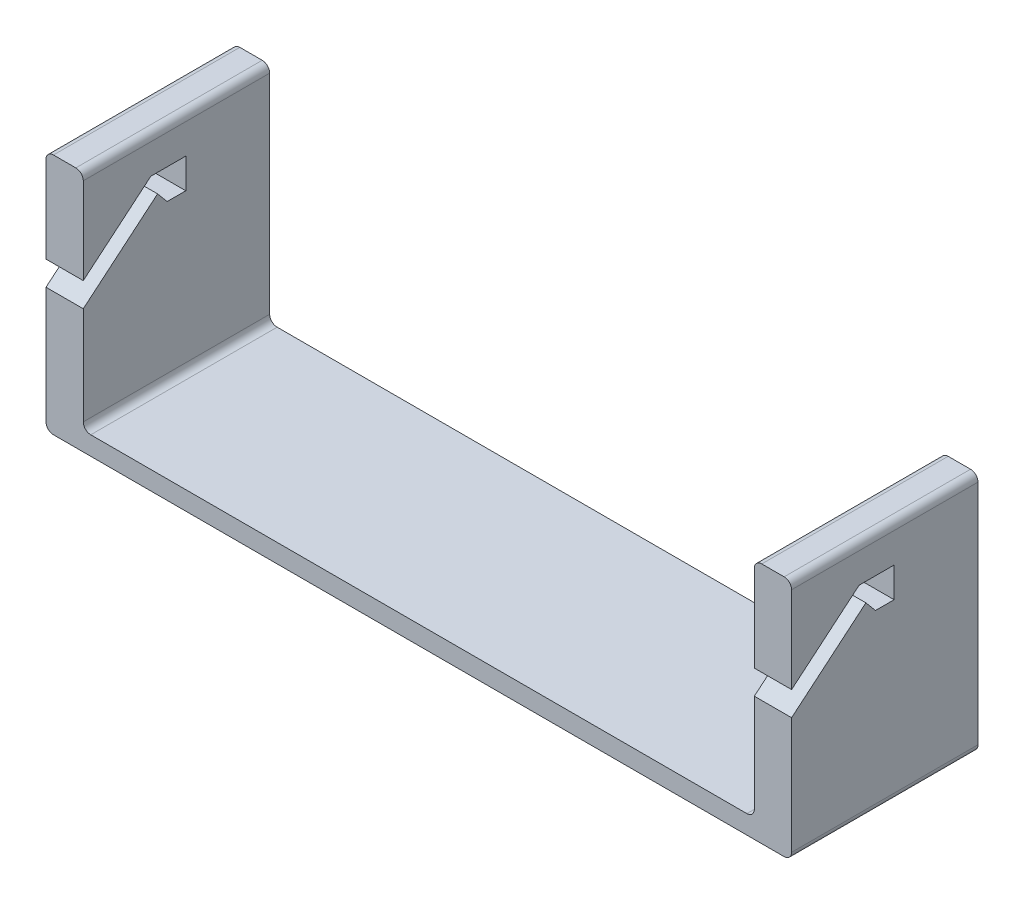
ISO-10303-21;
HEADER;
FILE_DESCRIPTION(('STEP AP214'),'2;1');
FILE_NAME('part.step','',(''),(''),'','','');
FILE_SCHEMA(('AUTOMOTIVE_DESIGN { 1 0 10303 214 1 1 1 1 }'));
ENDSEC;
DATA;
#1=APPLICATION_CONTEXT('core data for automotive mechanical design processes');
#2=APPLICATION_PROTOCOL_DEFINITION('international standard','automotive_design',2000,#1);
#3=PRODUCT_CONTEXT('',#1,'mechanical');
#4=PRODUCT('Part','Part','',(#3));
#5=PRODUCT_RELATED_PRODUCT_CATEGORY('part','',(#4));
#6=PRODUCT_DEFINITION_FORMATION('','',#4);
#7=PRODUCT_DEFINITION_CONTEXT('part definition',#1,'design');
#8=PRODUCT_DEFINITION('design','',#6,#7);
#9=PRODUCT_DEFINITION_SHAPE('','',#8);
#10=(LENGTH_UNIT() NAMED_UNIT(*) SI_UNIT(.MILLI.,.METRE.));
#11=(NAMED_UNIT(*) PLANE_ANGLE_UNIT() SI_UNIT($,.RADIAN.));
#12=(NAMED_UNIT(*) SI_UNIT($,.STERADIAN.) SOLID_ANGLE_UNIT());
#13=UNCERTAINTY_MEASURE_WITH_UNIT(LENGTH_MEASURE(1.E-05),#10,'distance_accuracy_value','');
#14=(GEOMETRIC_REPRESENTATION_CONTEXT(3) GLOBAL_UNCERTAINTY_ASSIGNED_CONTEXT((#13)) GLOBAL_UNIT_ASSIGNED_CONTEXT((#10,
#11,#12)) REPRESENTATION_CONTEXT('',''));
#15=CARTESIAN_POINT('',(0.,0.,0.));
#16=DIRECTION('',(0.,0.,1.));
#17=DIRECTION('',(1.,0.,0.));
#18=AXIS2_PLACEMENT_3D('',#15,#16,#17);
#19=CARTESIAN_POINT('',(100.,5.,25.));
#20=DIRECTION('',(0.,0.,-1.));
#21=DIRECTION('',(-1.,0.,0.));
#22=AXIS2_PLACEMENT_3D('',#19,#20,#21);
#23=PLANE('',#22);
#24=DIRECTION('',(1.,0.,0.));
#25=VECTOR('',#24,1.);
#26=CARTESIAN_POINT('',(90.,65.,25.));
#27=LINE('',#26,#25);
#28=CARTESIAN_POINT('',(92.,65.,25.));
#29=VERTEX_POINT('',#28);
#30=CARTESIAN_POINT('',(98.,65.,25.));
#31=VERTEX_POINT('',#30);
#32=EDGE_CURVE('E409',#29,#31,#27,.T.);
#33=ORIENTED_EDGE('',*,*,#32,.F.);
#34=CARTESIAN_POINT('',(92.,63.,25.));
#35=DIRECTION('',(0.,0.,-1.));
#36=DIRECTION('',(-1.,0.,0.));
#37=AXIS2_PLACEMENT_3D('',#34,#35,#36);
#38=CIRCLE('',#37,2.);
#39=CARTESIAN_POINT('',(90.,63.,25.));
#40=VERTEX_POINT('',#39);
#41=EDGE_CURVE('E352',#29,#40,#38,.F.);
#42=ORIENTED_EDGE('',*,*,#41,.T.);
#43=DIRECTION('',(0.,1.,0.));
#44=VECTOR('',#43,1.);
#45=CARTESIAN_POINT('',(90.,5.,25.));
#46=LINE('',#45,#44);
#47=CARTESIAN_POINT('',(90.,39.8047461300257,25.));
#48=VERTEX_POINT('',#47);
#49=EDGE_CURVE('E399',#48,#40,#46,.T.);
#50=ORIENTED_EDGE('',*,*,#49,.F.);
#51=DIRECTION('',(1.,0.,0.));
#52=VECTOR('',#51,1.);
#53=CARTESIAN_POINT('',(-100.,39.8047461300257,25.));
#54=LINE('',#53,#52);
#55=CARTESIAN_POINT('',(100.,39.8047461300257,25.));
#56=VERTEX_POINT('',#55);
#57=EDGE_CURVE('E400',#48,#56,#54,.T.);
#58=ORIENTED_EDGE('',*,*,#57,.T.);
#59=DIRECTION('',(0.,-1.,0.));
#60=VECTOR('',#59,1.);
#61=CARTESIAN_POINT('',(100.,5.,25.));
#62=LINE('',#61,#60);
#63=CARTESIAN_POINT('',(100.,63.,25.));
#64=VERTEX_POINT('',#63);
#65=EDGE_CURVE('E269',#64,#56,#62,.T.);
#66=ORIENTED_EDGE('',*,*,#65,.F.);
#67=CARTESIAN_POINT('',(98.,63.,25.));
#68=DIRECTION('',(0.,0.,-1.));
#69=DIRECTION('',(-1.,0.,0.));
#70=AXIS2_PLACEMENT_3D('',#67,#68,#69);
#71=CIRCLE('',#70,2.);
#72=EDGE_CURVE('E350',#64,#31,#71,.F.);
#73=ORIENTED_EDGE('',*,*,#72,.T.);
#74=EDGE_LOOP('',(#33,#42,#50,#58,#66,#73));
#75=FACE_BOUND('',#74,.T.);
#76=ADVANCED_FACE('F40',(#75),#23,.F.);
#77=DIRECTION('',(0.,-1.,0.));
#78=VECTOR('',#77,1.);
#79=CARTESIAN_POINT('',(-100.,5.,25.));
#80=LINE('',#79,#78);
#81=CARTESIAN_POINT('',(-100.,33.2777096833643,25.));
#82=VERTEX_POINT('',#81);
#83=CARTESIAN_POINT('',(-100.,2.,25.));
#84=VERTEX_POINT('',#83);
#85=EDGE_CURVE('E272',#82,#84,#80,.T.);
#86=ORIENTED_EDGE('',*,*,#85,.T.);
#87=CARTESIAN_POINT('',(-98.,2.,25.));
#88=DIRECTION('',(0.,0.,-1.));
#89=DIRECTION('',(-1.,0.,0.));
#90=AXIS2_PLACEMENT_3D('',#87,#88,#89);
#91=CIRCLE('',#90,2.);
#92=CARTESIAN_POINT('',(-98.,0.,25.));
#93=VERTEX_POINT('',#92);
#94=EDGE_CURVE('E317',#84,#93,#91,.F.);
#95=ORIENTED_EDGE('',*,*,#94,.T.);
#96=DIRECTION('',(1.,0.,0.));
#97=VECTOR('',#96,1.);
#98=CARTESIAN_POINT('',(100.,0.,25.));
#99=LINE('',#98,#97);
#100=CARTESIAN_POINT('',(98.,0.,25.));
#101=VERTEX_POINT('',#100);
#102=EDGE_CURVE('E456',#93,#101,#99,.T.);
#103=ORIENTED_EDGE('',*,*,#102,.T.);
#104=CARTESIAN_POINT('',(98.,2.,25.));
#105=DIRECTION('',(0.,0.,-1.));
#106=DIRECTION('',(-1.,0.,0.));
#107=AXIS2_PLACEMENT_3D('',#104,#105,#106);
#108=CIRCLE('',#107,2.);
#109=CARTESIAN_POINT('',(100.,2.,25.));
#110=VERTEX_POINT('',#109);
#111=EDGE_CURVE('E268',#101,#110,#108,.F.);
#112=ORIENTED_EDGE('',*,*,#111,.T.);
#113=CARTESIAN_POINT('',(100.,33.2777096833643,25.));
#114=VERTEX_POINT('',#113);
#115=EDGE_CURVE('E258',#114,#110,#62,.T.);
#116=ORIENTED_EDGE('',*,*,#115,.F.);
#117=DIRECTION('',(1.,0.,0.));
#118=VECTOR('',#117,1.);
#119=CARTESIAN_POINT('',(-100.,33.2777096833643,25.));
#120=LINE('',#119,#118);
#121=CARTESIAN_POINT('',(90.,33.2777096833643,25.));
#122=VERTEX_POINT('',#121);
#123=EDGE_CURVE('E241',#122,#114,#120,.T.);
#124=ORIENTED_EDGE('',*,*,#123,.F.);
#125=CARTESIAN_POINT('',(90.,7.,25.));
#126=VERTEX_POINT('',#125);
#127=EDGE_CURVE('E376',#126,#122,#46,.T.);
#128=ORIENTED_EDGE('',*,*,#127,.F.);
#129=CARTESIAN_POINT('',(88.,7.,25.));
#130=DIRECTION('',(0.,0.,-1.));
#131=DIRECTION('',(-1.,0.,0.));
#132=AXIS2_PLACEMENT_3D('',#129,#130,#131);
#133=CIRCLE('',#132,2.);
#134=CARTESIAN_POINT('',(88.,5.,25.));
#135=VERTEX_POINT('',#134);
#136=EDGE_CURVE('E48',#126,#135,#133,.T.);
#137=ORIENTED_EDGE('',*,*,#136,.T.);
#138=DIRECTION('',(1.,0.,0.));
#139=VECTOR('',#138,1.);
#140=CARTESIAN_POINT('',(100.,5.,25.));
#141=LINE('',#140,#139);
#142=CARTESIAN_POINT('',(-88.,5.,25.));
#143=VERTEX_POINT('',#142);
#144=EDGE_CURVE('E375',#143,#135,#141,.T.);
#145=ORIENTED_EDGE('',*,*,#144,.F.);
#146=CARTESIAN_POINT('',(-88.,7.,25.));
#147=DIRECTION('',(0.,0.,-1.));
#148=DIRECTION('',(-1.,0.,0.));
#149=AXIS2_PLACEMENT_3D('',#146,#147,#148);
#150=CIRCLE('',#149,2.);
#151=CARTESIAN_POINT('',(-90.,7.,25.));
#152=VERTEX_POINT('',#151);
#153=EDGE_CURVE('E370',#143,#152,#150,.T.);
#154=ORIENTED_EDGE('',*,*,#153,.T.);
#155=DIRECTION('',(0.,1.,0.));
#156=VECTOR('',#155,1.);
#157=CARTESIAN_POINT('',(-90.,5.,25.));
#158=LINE('',#157,#156);
#159=CARTESIAN_POINT('',(-90.,33.2777096833643,25.));
#160=VERTEX_POINT('',#159);
#161=EDGE_CURVE('E448',#152,#160,#158,.T.);
#162=ORIENTED_EDGE('',*,*,#161,.T.);
#163=DIRECTION('',(-1.,0.,0.));
#164=VECTOR('',#163,1.);
#165=CARTESIAN_POINT('',(100.,33.2777096833643,25.));
#166=LINE('',#165,#164);
#167=EDGE_CURVE('E432',#160,#82,#166,.T.);
#168=ORIENTED_EDGE('',*,*,#167,.T.);
#169=EDGE_LOOP('',(#86,#95,#103,#112,#116,#124,#128,#137,#145,#154,#162,#168));
#170=FACE_BOUND('',#169,.T.);
#171=ADVANCED_FACE('F265',(#170),#23,.F.);
#172=CARTESIAN_POINT('',(100.,5.,25.));
#173=DIRECTION('',(-1.,0.,0.));
#174=DIRECTION('',(0.,0.,1.));
#175=AXIS2_PLACEMENT_3D('',#172,#173,#174);
#176=PLANE('',#175);
#177=ORIENTED_EDGE('',*,*,#115,.T.);
#178=DIRECTION('',(0.,0.,-1.));
#179=VECTOR('',#178,1.);
#180=CARTESIAN_POINT('',(100.,2.,25.));
#181=LINE('',#180,#179);
#182=CARTESIAN_POINT('',(100.,2.,-25.));
#183=VERTEX_POINT('',#182);
#184=EDGE_CURVE('E337',#110,#183,#181,.T.);
#185=ORIENTED_EDGE('',*,*,#184,.T.);
#186=DIRECTION('',(0.,-1.,0.));
#187=VECTOR('',#186,1.);
#188=CARTESIAN_POINT('',(100.,5.,-25.));
#189=LINE('',#188,#187);
#190=CARTESIAN_POINT('',(100.,63.,-25.));
#191=VERTEX_POINT('',#190);
#192=EDGE_CURVE('E270',#191,#183,#189,.T.);
#193=ORIENTED_EDGE('',*,*,#192,.F.);
#194=DIRECTION('',(0.,0.,-1.));
#195=VECTOR('',#194,1.);
#196=CARTESIAN_POINT('',(100.,63.,25.));
#197=LINE('',#196,#195);
#198=EDGE_CURVE('E335',#191,#64,#197,.F.);
#199=ORIENTED_EDGE('',*,*,#198,.T.);
#200=ORIENTED_EDGE('',*,*,#65,.T.);
#201=DIRECTION('',(0.,0.64278760968654,-0.766044443118978));
#202=VECTOR('',#201,1.);
#203=CARTESIAN_POINT('',(100.,39.8047461300257,25.));
#204=LINE('',#203,#202);
#205=CARTESIAN_POINT('',(100.,55.,6.89100161007714));
#206=VERTEX_POINT('',#205);
#207=EDGE_CURVE('E252',#56,#206,#204,.T.);
#208=ORIENTED_EDGE('',*,*,#207,.T.);
#209=DIRECTION('',(0.,0.,-1.));
#210=VECTOR('',#209,1.);
#211=CARTESIAN_POINT('',(100.,55.,6.89100161007714));
#212=LINE('',#211,#210);
#213=CARTESIAN_POINT('',(100.,55.,-2.5));
#214=VERTEX_POINT('',#213);
#215=EDGE_CURVE('E975',#206,#214,#212,.T.);
#216=ORIENTED_EDGE('',*,*,#215,.T.);
#217=DIRECTION('',(0.,-1.,0.));
#218=VECTOR('',#217,1.);
#219=CARTESIAN_POINT('',(100.,55.,-2.5));
#220=LINE('',#219,#218);
#221=CARTESIAN_POINT('',(100.,46.9358222275241,-2.5));
#222=VERTEX_POINT('',#221);
#223=EDGE_CURVE('E978',#214,#222,#220,.T.);
#224=ORIENTED_EDGE('',*,*,#223,.T.);
#225=DIRECTION('',(0.,0.,1.));
#226=VECTOR('',#225,1.);
#227=CARTESIAN_POINT('',(100.,46.9358222275241,-2.5));
#228=LINE('',#227,#226);
#229=CARTESIAN_POINT('',(100.,46.9358222275241,2.5));
#230=VERTEX_POINT('',#229);
#231=EDGE_CURVE('E964',#222,#230,#228,.T.);
#232=ORIENTED_EDGE('',*,*,#231,.T.);
#233=DIRECTION('',(0.,0.766044443118978,0.642787609686539));
#234=VECTOR('',#233,1.);
#235=CARTESIAN_POINT('',(100.,46.9358222275241,2.5));
#236=LINE('',#235,#234);
#237=CARTESIAN_POINT('',(100.,50.,5.07115043874616));
#238=VERTEX_POINT('',#237);
#239=EDGE_CURVE('E262',#230,#238,#236,.T.);
#240=ORIENTED_EDGE('',*,*,#239,.T.);
#241=DIRECTION('',(0.,-0.64278760968654,0.766044443118977));
#242=VECTOR('',#241,1.);
#243=CARTESIAN_POINT('',(100.,50.,5.07115043874616));
#244=LINE('',#243,#242);
#245=EDGE_CURVE('E244',#238,#114,#244,.T.);
#246=ORIENTED_EDGE('',*,*,#245,.T.);
#247=EDGE_LOOP('',(#177,#185,#193,#199,#200,#208,#216,#224,#232,#240,#246));
#248=FACE_BOUND('',#247,.T.);
#249=ADVANCED_FACE('F256',(#248),#176,.F.);
#250=CARTESIAN_POINT('',(90.,0.,0.));
#251=DIRECTION('',(1.,0.,0.));
#252=DIRECTION('',(0.,0.,1.));
#253=AXIS2_PLACEMENT_3D('',#250,#251,#252);
#254=PLANE('',#253);
#255=ORIENTED_EDGE('',*,*,#49,.T.);
#256=DIRECTION('',(0.,0.,-1.));
#257=VECTOR('',#256,1.);
#258=CARTESIAN_POINT('',(90.,63.,0.));
#259=LINE('',#258,#257);
#260=CARTESIAN_POINT('',(90.,63.,-25.));
#261=VERTEX_POINT('',#260);
#262=EDGE_CURVE('E342',#40,#261,#259,.T.);
#263=ORIENTED_EDGE('',*,*,#262,.T.);
#264=DIRECTION('',(0.,-1.,0.));
#265=VECTOR('',#264,1.);
#266=CARTESIAN_POINT('',(90.,65.,-25.));
#267=LINE('',#266,#265);
#268=CARTESIAN_POINT('',(90.,7.00000000000001,-25.));
#269=VERTEX_POINT('',#268);
#270=EDGE_CURVE('E394',#261,#269,#267,.T.);
#271=ORIENTED_EDGE('',*,*,#270,.T.);
#272=DIRECTION('',(0.,0.,1.));
#273=VECTOR('',#272,1.);
#274=CARTESIAN_POINT('',(90.,7.,0.));
#275=LINE('',#274,#273);
#276=EDGE_CURVE('E339',#269,#126,#275,.T.);
#277=ORIENTED_EDGE('',*,*,#276,.T.);
#278=ORIENTED_EDGE('',*,*,#127,.T.);
#279=DIRECTION('',(0.,-0.64278760968654,0.766044443118977));
#280=VECTOR('',#279,1.);
#281=CARTESIAN_POINT('',(90.,31.8382585760574,26.7154710284967));
#282=LINE('',#281,#280);
#283=CARTESIAN_POINT('',(90.,50.,5.07115043874616));
#284=VERTEX_POINT('',#283);
#285=EDGE_CURVE('E247',#284,#122,#282,.T.);
#286=ORIENTED_EDGE('',*,*,#285,.F.);
#287=DIRECTION('',(0.,0.766044443118978,0.642787609686539));
#288=VECTOR('',#287,1.);
#289=CARTESIAN_POINT('',(90.,18.1617414239425,-21.6443205897506));
#290=LINE('',#289,#288);
#291=CARTESIAN_POINT('',(90.,46.9358222275241,2.5));
#292=VERTEX_POINT('',#291);
#293=EDGE_CURVE('E299',#292,#284,#290,.T.);
#294=ORIENTED_EDGE('',*,*,#293,.F.);
#295=DIRECTION('',(0.,0.,1.));
#296=VECTOR('',#295,1.);
#297=CARTESIAN_POINT('',(90.,46.9358222275241,0.));
#298=LINE('',#297,#296);
#299=CARTESIAN_POINT('',(90.,46.9358222275241,-2.5));
#300=VERTEX_POINT('',#299);
#301=EDGE_CURVE('E302',#300,#292,#298,.T.);
#302=ORIENTED_EDGE('',*,*,#301,.F.);
#303=DIRECTION('',(0.,-1.,0.));
#304=VECTOR('',#303,1.);
#305=CARTESIAN_POINT('',(90.,0.,-2.49999999999999));
#306=LINE('',#305,#304);
#307=CARTESIAN_POINT('',(90.,55.,-2.5));
#308=VERTEX_POINT('',#307);
#309=EDGE_CURVE('E304',#308,#300,#306,.T.);
#310=ORIENTED_EDGE('',*,*,#309,.F.);
#311=DIRECTION('',(0.,0.,-1.));
#312=VECTOR('',#311,1.);
#313=CARTESIAN_POINT('',(90.,55.,0.));
#314=LINE('',#313,#312);
#315=CARTESIAN_POINT('',(90.,55.,6.89100161007714));
#316=VERTEX_POINT('',#315);
#317=EDGE_CURVE('E306',#316,#308,#314,.T.);
#318=ORIENTED_EDGE('',*,*,#317,.F.);
#319=DIRECTION('',(0.,0.64278760968654,-0.766044443118978));
#320=VECTOR('',#319,1.);
#321=CARTESIAN_POINT('',(90.,35.6684807916523,29.9294090769294));
#322=LINE('',#321,#320);
#323=EDGE_CURVE('E308',#48,#316,#322,.T.);
#324=ORIENTED_EDGE('',*,*,#323,.F.);
#325=EDGE_LOOP('',(#255,#263,#271,#277,#278,#286,#294,#302,#310,#318,#324));
#326=FACE_BOUND('',#325,.T.);
#327=ADVANCED_FACE('F397',(#326),#254,.F.);
#328=CARTESIAN_POINT('',(0.,5.,0.));
#329=DIRECTION('',(0.,1.,0.));
#330=DIRECTION('',(0.,0.,1.));
#331=AXIS2_PLACEMENT_3D('',#328,#329,#330);
#332=PLANE('',#331);
#333=DIRECTION('',(-1.,0.,0.));
#334=VECTOR('',#333,1.);
#335=CARTESIAN_POINT('',(100.,5.,-25.));
#336=LINE('',#335,#334);
#337=CARTESIAN_POINT('',(88.,5.,-25.));
#338=VERTEX_POINT('',#337);
#339=CARTESIAN_POINT('',(-88.,5.,-25.));
#340=VERTEX_POINT('',#339);
#341=EDGE_CURVE('E385',#338,#340,#336,.T.);
#342=ORIENTED_EDGE('',*,*,#341,.T.);
#343=DIRECTION('',(0.,0.,1.));
#344=VECTOR('',#343,1.);
#345=CARTESIAN_POINT('',(-88.,5.,0.));
#346=LINE('',#345,#344);
#347=EDGE_CURVE('E367',#340,#143,#346,.T.);
#348=ORIENTED_EDGE('',*,*,#347,.T.);
#349=ORIENTED_EDGE('',*,*,#144,.T.);
#350=DIRECTION('',(0.,0.,1.));
#351=VECTOR('',#350,1.);
#352=CARTESIAN_POINT('',(88.,5.,0.));
#353=LINE('',#352,#351);
#354=EDGE_CURVE('E365',#135,#338,#353,.F.);
#355=ORIENTED_EDGE('',*,*,#354,.T.);
#356=EDGE_LOOP('',(#342,#348,#349,#355));
#357=FACE_BOUND('',#356,.T.);
#358=ADVANCED_FACE('F382',(#357),#332,.T.);
#359=CARTESIAN_POINT('',(-100.,5.,25.));
#360=DIRECTION('',(1.,0.,0.));
#361=DIRECTION('',(0.,0.,-1.));
#362=AXIS2_PLACEMENT_3D('',#359,#360,#361);
#363=PLANE('',#362);
#364=DIRECTION('',(0.,-1.,0.));
#365=VECTOR('',#364,1.);
#366=CARTESIAN_POINT('',(-100.,5.,-25.));
#367=LINE('',#366,#365);
#368=CARTESIAN_POINT('',(-100.,63.,-25.));
#369=VERTEX_POINT('',#368);
#370=CARTESIAN_POINT('',(-100.,2.,-25.));
#371=VERTEX_POINT('',#370);
#372=EDGE_CURVE('E274',#369,#371,#367,.T.);
#373=ORIENTED_EDGE('',*,*,#372,.T.);
#374=DIRECTION('',(0.,0.,1.));
#375=VECTOR('',#374,1.);
#376=CARTESIAN_POINT('',(-100.,2.,25.));
#377=LINE('',#376,#375);
#378=EDGE_CURVE('E313',#371,#84,#377,.T.);
#379=ORIENTED_EDGE('',*,*,#378,.T.);
#380=ORIENTED_EDGE('',*,*,#85,.F.);
#381=DIRECTION('',(0.,-0.64278760968654,0.766044443118977));
#382=VECTOR('',#381,1.);
#383=CARTESIAN_POINT('',(-100.,50.,5.07115043874616));
#384=LINE('',#383,#382);
#385=CARTESIAN_POINT('',(-100.,50.,5.07115043874616));
#386=VERTEX_POINT('',#385);
#387=EDGE_CURVE('E429',#386,#82,#384,.T.);
#388=ORIENTED_EDGE('',*,*,#387,.F.);
#389=DIRECTION('',(0.,0.766044443118978,0.642787609686539));
#390=VECTOR('',#389,1.);
#391=CARTESIAN_POINT('',(-100.,46.9358222275241,2.5));
#392=LINE('',#391,#390);
#393=CARTESIAN_POINT('',(-100.,46.9358222275241,2.5));
#394=VERTEX_POINT('',#393);
#395=EDGE_CURVE('E426',#394,#386,#392,.T.);
#396=ORIENTED_EDGE('',*,*,#395,.F.);
#397=DIRECTION('',(0.,0.,1.));
#398=VECTOR('',#397,1.);
#399=CARTESIAN_POINT('',(-100.,46.9358222275241,-2.5));
#400=LINE('',#399,#398);
#401=CARTESIAN_POINT('',(-100.,46.9358222275241,-2.5));
#402=VERTEX_POINT('',#401);
#403=EDGE_CURVE('E423',#402,#394,#400,.T.);
#404=ORIENTED_EDGE('',*,*,#403,.F.);
#405=DIRECTION('',(0.,-1.,0.));
#406=VECTOR('',#405,1.);
#407=CARTESIAN_POINT('',(-100.,55.,-2.5));
#408=LINE('',#407,#406);
#409=CARTESIAN_POINT('',(-100.,55.,-2.5));
#410=VERTEX_POINT('',#409);
#411=EDGE_CURVE('E420',#410,#402,#408,.T.);
#412=ORIENTED_EDGE('',*,*,#411,.F.);
#413=DIRECTION('',(0.,0.,-1.));
#414=VECTOR('',#413,1.);
#415=CARTESIAN_POINT('',(-100.,55.,6.89100161007714));
#416=LINE('',#415,#414);
#417=CARTESIAN_POINT('',(-100.,55.,6.89100161007714));
#418=VERTEX_POINT('',#417);
#419=EDGE_CURVE('E417',#418,#410,#416,.T.);
#420=ORIENTED_EDGE('',*,*,#419,.F.);
#421=DIRECTION('',(0.,0.64278760968654,-0.766044443118978));
#422=VECTOR('',#421,1.);
#423=CARTESIAN_POINT('',(-100.,39.8047461300257,25.));
#424=LINE('',#423,#422);
#425=CARTESIAN_POINT('',(-100.,39.8047461300257,25.));
#426=VERTEX_POINT('',#425);
#427=EDGE_CURVE('E412',#426,#418,#424,.T.);
#428=ORIENTED_EDGE('',*,*,#427,.F.);
#429=CARTESIAN_POINT('',(-100.,63.,25.));
#430=VERTEX_POINT('',#429);
#431=EDGE_CURVE('E278',#430,#426,#80,.T.);
#432=ORIENTED_EDGE('',*,*,#431,.F.);
#433=DIRECTION('',(0.,0.,-1.));
#434=VECTOR('',#433,1.);
#435=CARTESIAN_POINT('',(-100.,63.,-25.));
#436=LINE('',#435,#434);
#437=EDGE_CURVE('E310',#430,#369,#436,.T.);
#438=ORIENTED_EDGE('',*,*,#437,.T.);
#439=EDGE_LOOP('',(#373,#379,#380,#388,#396,#404,#412,#420,#428,#432,#438));
#440=FACE_BOUND('',#439,.T.);
#441=ADVANCED_FACE('F464',(#440),#363,.F.);
#442=DIRECTION('',(-1.,0.,0.));
#443=VECTOR('',#442,1.);
#444=CARTESIAN_POINT('',(-90.,65.,25.));
#445=LINE('',#444,#443);
#446=CARTESIAN_POINT('',(-92.,65.,25.));
#447=VERTEX_POINT('',#446);
#448=CARTESIAN_POINT('',(-98.,65.,25.));
#449=VERTEX_POINT('',#448);
#450=EDGE_CURVE('E453',#447,#449,#445,.T.);
#451=ORIENTED_EDGE('',*,*,#450,.T.);
#452=CARTESIAN_POINT('',(-98.,63.,25.));
#453=DIRECTION('',(0.,0.,-1.));
#454=DIRECTION('',(-1.,0.,0.));
#455=AXIS2_PLACEMENT_3D('',#452,#453,#454);
#456=CIRCLE('',#455,2.);
#457=EDGE_CURVE('E360',#449,#430,#456,.F.);
#458=ORIENTED_EDGE('',*,*,#457,.T.);
#459=ORIENTED_EDGE('',*,*,#431,.T.);
#460=DIRECTION('',(-1.,0.,0.));
#461=VECTOR('',#460,1.);
#462=CARTESIAN_POINT('',(100.,39.8047461300257,25.));
#463=LINE('',#462,#461);
#464=CARTESIAN_POINT('',(-90.,39.8047461300257,25.));
#465=VERTEX_POINT('',#464);
#466=EDGE_CURVE('E431',#465,#426,#463,.T.);
#467=ORIENTED_EDGE('',*,*,#466,.F.);
#468=CARTESIAN_POINT('',(-90.,63.,25.));
#469=VERTEX_POINT('',#468);
#470=EDGE_CURVE('E435',#465,#469,#158,.T.);
#471=ORIENTED_EDGE('',*,*,#470,.T.);
#472=CARTESIAN_POINT('',(-92.,63.,25.));
#473=DIRECTION('',(0.,0.,-1.));
#474=DIRECTION('',(-1.,0.,0.));
#475=AXIS2_PLACEMENT_3D('',#472,#473,#474);
#476=CIRCLE('',#475,2.);
#477=EDGE_CURVE('E358',#469,#447,#476,.F.);
#478=ORIENTED_EDGE('',*,*,#477,.T.);
#479=EDGE_LOOP('',(#451,#458,#459,#467,#471,#478));
#480=FACE_BOUND('',#479,.T.);
#481=ADVANCED_FACE('F507',(#480),#23,.F.);
#482=CARTESIAN_POINT('',(100.,5.,-25.));
#483=DIRECTION('',(0.,0.,1.));
#484=DIRECTION('',(1.,0.,0.));
#485=AXIS2_PLACEMENT_3D('',#482,#483,#484);
#486=PLANE('',#485);
#487=DIRECTION('',(-1.,0.,0.));
#488=VECTOR('',#487,1.);
#489=CARTESIAN_POINT('',(100.,0.,-25.));
#490=LINE('',#489,#488);
#491=CARTESIAN_POINT('',(98.,0.,-25.));
#492=VERTEX_POINT('',#491);
#493=CARTESIAN_POINT('',(-98.,0.,-25.));
#494=VERTEX_POINT('',#493);
#495=EDGE_CURVE('E386',#492,#494,#490,.T.);
#496=ORIENTED_EDGE('',*,*,#495,.T.);
#497=CARTESIAN_POINT('',(-98.,2.,-25.));
#498=DIRECTION('',(0.,0.,1.));
#499=DIRECTION('',(1.,0.,0.));
#500=AXIS2_PLACEMENT_3D('',#497,#498,#499);
#501=CIRCLE('',#500,2.);
#502=EDGE_CURVE('E333',#494,#371,#501,.F.);
#503=ORIENTED_EDGE('',*,*,#502,.T.);
#504=ORIENTED_EDGE('',*,*,#372,.F.);
#505=CARTESIAN_POINT('',(-98.,63.,-25.));
#506=DIRECTION('',(0.,0.,1.));
#507=DIRECTION('',(1.,0.,0.));
#508=AXIS2_PLACEMENT_3D('',#505,#506,#507);
#509=CIRCLE('',#508,2.);
#510=CARTESIAN_POINT('',(-98.,65.,-25.));
#511=VERTEX_POINT('',#510);
#512=EDGE_CURVE('E325',#369,#511,#509,.F.);
#513=ORIENTED_EDGE('',*,*,#512,.T.);
#514=DIRECTION('',(-1.,0.,0.));
#515=VECTOR('',#514,1.);
#516=CARTESIAN_POINT('',(-90.,65.,-25.));
#517=LINE('',#516,#515);
#518=CARTESIAN_POINT('',(-92.,65.,-25.));
#519=VERTEX_POINT('',#518);
#520=EDGE_CURVE('E454',#519,#511,#517,.T.);
#521=ORIENTED_EDGE('',*,*,#520,.F.);
#522=CARTESIAN_POINT('',(-92.,63.,-25.));
#523=DIRECTION('',(0.,0.,1.));
#524=DIRECTION('',(1.,0.,0.));
#525=AXIS2_PLACEMENT_3D('',#522,#523,#524);
#526=CIRCLE('',#525,2.);
#527=CARTESIAN_POINT('',(-90.,63.,-25.));
#528=VERTEX_POINT('',#527);
#529=EDGE_CURVE('E323',#519,#528,#526,.F.);
#530=ORIENTED_EDGE('',*,*,#529,.T.);
#531=DIRECTION('',(0.,-1.,0.));
#532=VECTOR('',#531,1.);
#533=CARTESIAN_POINT('',(-90.,65.,-25.));
#534=LINE('',#533,#532);
#535=CARTESIAN_POINT('',(-90.,7.00000000000001,-25.));
#536=VERTEX_POINT('',#535);
#537=EDGE_CURVE('E450',#528,#536,#534,.T.);
#538=ORIENTED_EDGE('',*,*,#537,.T.);
#539=CARTESIAN_POINT('',(-88.,7.,-25.));
#540=DIRECTION('',(0.,0.,1.));
#541=DIRECTION('',(1.,0.,0.));
#542=AXIS2_PLACEMENT_3D('',#539,#540,#541);
#543=CIRCLE('',#542,2.);
#544=EDGE_CURVE('E372',#536,#340,#543,.T.);
#545=ORIENTED_EDGE('',*,*,#544,.T.);
#546=ORIENTED_EDGE('',*,*,#341,.F.);
#547=CARTESIAN_POINT('',(88.,7.,-25.));
#548=DIRECTION('',(0.,0.,1.));
#549=DIRECTION('',(1.,0.,0.));
#550=AXIS2_PLACEMENT_3D('',#547,#548,#549);
#551=CIRCLE('',#550,2.);
#552=EDGE_CURVE('E11',#338,#269,#551,.T.);
#553=ORIENTED_EDGE('',*,*,#552,.T.);
#554=ORIENTED_EDGE('',*,*,#270,.F.);
#555=CARTESIAN_POINT('',(92.,63.,-25.));
#556=DIRECTION('',(0.,0.,1.));
#557=DIRECTION('',(1.,0.,0.));
#558=AXIS2_PLACEMENT_3D('',#555,#556,#557);
#559=CIRCLE('',#558,2.);
#560=CARTESIAN_POINT('',(92.,65.,-25.));
#561=VERTEX_POINT('',#560);
#562=EDGE_CURVE('E329',#261,#561,#559,.F.);
#563=ORIENTED_EDGE('',*,*,#562,.T.);
#564=DIRECTION('',(1.,0.,0.));
#565=VECTOR('',#564,1.);
#566=CARTESIAN_POINT('',(90.,65.,-25.));
#567=LINE('',#566,#565);
#568=CARTESIAN_POINT('',(98.,65.,-25.));
#569=VERTEX_POINT('',#568);
#570=EDGE_CURVE('E408',#561,#569,#567,.T.);
#571=ORIENTED_EDGE('',*,*,#570,.T.);
#572=CARTESIAN_POINT('',(98.,63.,-25.));
#573=DIRECTION('',(0.,0.,1.));
#574=DIRECTION('',(1.,0.,0.));
#575=AXIS2_PLACEMENT_3D('',#572,#573,#574);
#576=CIRCLE('',#575,2.);
#577=EDGE_CURVE('E327',#569,#191,#576,.F.);
#578=ORIENTED_EDGE('',*,*,#577,.T.);
#579=ORIENTED_EDGE('',*,*,#192,.T.);
#580=CARTESIAN_POINT('',(98.,2.,-25.));
#581=DIRECTION('',(0.,0.,1.));
#582=DIRECTION('',(1.,0.,0.));
#583=AXIS2_PLACEMENT_3D('',#580,#581,#582);
#584=CIRCLE('',#583,2.);
#585=EDGE_CURVE('E331',#183,#492,#584,.F.);
#586=ORIENTED_EDGE('',*,*,#585,.T.);
#587=EDGE_LOOP('',(#496,#503,#504,#513,#521,#530,#538,#545,#546,#553,#554,#563,#571,#578,#579,#586));
#588=FACE_BOUND('',#587,.T.);
#589=ADVANCED_FACE('F393',(#588),#486,.F.);
#590=CARTESIAN_POINT('',(0.,0.,0.));
#591=DIRECTION('',(0.,1.,0.));
#592=DIRECTION('',(0.,0.,1.));
#593=AXIS2_PLACEMENT_3D('',#590,#591,#592);
#594=PLANE('',#593);
#595=ORIENTED_EDGE('',*,*,#102,.F.);
#596=DIRECTION('',(0.,0.,1.));
#597=VECTOR('',#596,1.);
#598=CARTESIAN_POINT('',(-98.,0.,0.));
#599=LINE('',#598,#597);
#600=EDGE_CURVE('E321',#93,#494,#599,.F.);
#601=ORIENTED_EDGE('',*,*,#600,.T.);
#602=ORIENTED_EDGE('',*,*,#495,.F.);
#603=DIRECTION('',(0.,0.,-1.));
#604=VECTOR('',#603,1.);
#605=CARTESIAN_POINT('',(98.,0.,0.));
#606=LINE('',#605,#604);
#607=EDGE_CURVE('E319',#492,#101,#606,.F.);
#608=ORIENTED_EDGE('',*,*,#607,.T.);
#609=EDGE_LOOP('',(#595,#601,#602,#608));
#610=FACE_BOUND('',#609,.T.);
#611=ADVANCED_FACE('F474',(#610),#594,.F.);
#612=CARTESIAN_POINT('',(-90.,65.,25.));
#613=DIRECTION('',(0.,1.,0.));
#614=DIRECTION('',(0.,0.,1.));
#615=AXIS2_PLACEMENT_3D('',#612,#613,#614);
#616=PLANE('',#615);
#617=ORIENTED_EDGE('',*,*,#520,.T.);
#618=DIRECTION('',(0.,0.,-1.));
#619=VECTOR('',#618,1.);
#620=CARTESIAN_POINT('',(-98.,65.,25.));
#621=LINE('',#620,#619);
#622=EDGE_CURVE('E63',#511,#449,#621,.F.);
#623=ORIENTED_EDGE('',*,*,#622,.T.);
#624=ORIENTED_EDGE('',*,*,#450,.F.);
#625=DIRECTION('',(0.,0.,-1.));
#626=VECTOR('',#625,1.);
#627=CARTESIAN_POINT('',(-92.,65.,-25.));
#628=LINE('',#627,#626);
#629=EDGE_CURVE('E354',#447,#519,#628,.T.);
#630=ORIENTED_EDGE('',*,*,#629,.T.);
#631=EDGE_LOOP('',(#617,#623,#624,#630));
#632=FACE_BOUND('',#631,.T.);
#633=ADVANCED_FACE('F525',(#632),#616,.T.);
#634=CARTESIAN_POINT('',(-90.,0.,0.));
#635=DIRECTION('',(-1.,0.,0.));
#636=DIRECTION('',(0.,0.,1.));
#637=AXIS2_PLACEMENT_3D('',#634,#635,#636);
#638=PLANE('',#637);
#639=ORIENTED_EDGE('',*,*,#537,.F.);
#640=DIRECTION('',(0.,0.,-1.));
#641=VECTOR('',#640,1.);
#642=CARTESIAN_POINT('',(-90.,63.,25.));
#643=LINE('',#642,#641);
#644=EDGE_CURVE('E55',#528,#469,#643,.F.);
#645=ORIENTED_EDGE('',*,*,#644,.T.);
#646=ORIENTED_EDGE('',*,*,#470,.F.);
#647=DIRECTION('',(0.,0.64278760968654,-0.766044443118978));
#648=VECTOR('',#647,1.);
#649=CARTESIAN_POINT('',(-90.,35.6684807916523,29.9294090769294));
#650=LINE('',#649,#648);
#651=CARTESIAN_POINT('',(-90.,55.,6.89100161007715));
#652=VERTEX_POINT('',#651);
#653=EDGE_CURVE('E280',#465,#652,#650,.T.);
#654=ORIENTED_EDGE('',*,*,#653,.T.);
#655=DIRECTION('',(0.,0.,-1.));
#656=VECTOR('',#655,1.);
#657=CARTESIAN_POINT('',(-90.,55.,0.));
#658=LINE('',#657,#656);
#659=CARTESIAN_POINT('',(-90.,55.,-2.5));
#660=VERTEX_POINT('',#659);
#661=EDGE_CURVE('E283',#652,#660,#658,.T.);
#662=ORIENTED_EDGE('',*,*,#661,.T.);
#663=DIRECTION('',(0.,-1.,0.));
#664=VECTOR('',#663,1.);
#665=CARTESIAN_POINT('',(-90.,0.,-2.49999999999999));
#666=LINE('',#665,#664);
#667=CARTESIAN_POINT('',(-90.,46.9358222275241,-2.5));
#668=VERTEX_POINT('',#667);
#669=EDGE_CURVE('E286',#660,#668,#666,.T.);
#670=ORIENTED_EDGE('',*,*,#669,.T.);
#671=DIRECTION('',(0.,0.,1.));
#672=VECTOR('',#671,1.);
#673=CARTESIAN_POINT('',(-90.,46.9358222275241,0.));
#674=LINE('',#673,#672);
#675=CARTESIAN_POINT('',(-90.,46.9358222275241,2.5));
#676=VERTEX_POINT('',#675);
#677=EDGE_CURVE('E289',#668,#676,#674,.T.);
#678=ORIENTED_EDGE('',*,*,#677,.T.);
#679=DIRECTION('',(0.,0.766044443118978,0.642787609686539));
#680=VECTOR('',#679,1.);
#681=CARTESIAN_POINT('',(-90.,18.1617414239425,-21.6443205897506));
#682=LINE('',#681,#680);
#683=CARTESIAN_POINT('',(-90.,50.,5.07115043874616));
#684=VERTEX_POINT('',#683);
#685=EDGE_CURVE('E292',#676,#684,#682,.T.);
#686=ORIENTED_EDGE('',*,*,#685,.T.);
#687=DIRECTION('',(0.,-0.64278760968654,0.766044443118977));
#688=VECTOR('',#687,1.);
#689=CARTESIAN_POINT('',(-90.,31.8382585760574,26.7154710284967));
#690=LINE('',#689,#688);
#691=EDGE_CURVE('E295',#684,#160,#690,.T.);
#692=ORIENTED_EDGE('',*,*,#691,.T.);
#693=ORIENTED_EDGE('',*,*,#161,.F.);
#694=DIRECTION('',(0.,0.,1.));
#695=VECTOR('',#694,1.);
#696=CARTESIAN_POINT('',(-90.,7.,0.));
#697=LINE('',#696,#695);
#698=EDGE_CURVE('E362',#152,#536,#697,.F.);
#699=ORIENTED_EDGE('',*,*,#698,.T.);
#700=EDGE_LOOP('',(#639,#645,#646,#654,#662,#670,#678,#686,#692,#693,#699));
#701=FACE_BOUND('',#700,.T.);
#702=ADVANCED_FACE('F529',(#701),#638,.F.);
#703=CARTESIAN_POINT('',(100.,50.,5.07115043874616));
#704=DIRECTION('',(0.,-0.766044443118977,-0.64278760968654));
#705=DIRECTION('',(0.,0.64278760968654,-0.766044443118977));
#706=AXIS2_PLACEMENT_3D('',#703,#704,#705);
#707=PLANE('',#706);
#708=DIRECTION('',(-1.,0.,0.));
#709=VECTOR('',#708,1.);
#710=CARTESIAN_POINT('',(100.,50.,5.07115043874616));
#711=LINE('',#710,#709);
#712=EDGE_CURVE('E436',#684,#386,#711,.T.);
#713=ORIENTED_EDGE('',*,*,#712,.T.);
#714=ORIENTED_EDGE('',*,*,#387,.T.);
#715=ORIENTED_EDGE('',*,*,#167,.F.);
#716=ORIENTED_EDGE('',*,*,#691,.F.);
#717=EDGE_LOOP('',(#713,#714,#715,#716));
#718=FACE_BOUND('',#717,.T.);
#719=ADVANCED_FACE('F536',(#718),#707,.F.);
#720=CARTESIAN_POINT('',(100.,46.9358222275241,2.5));
#721=DIRECTION('',(0.,-0.642787609686539,0.766044443118978));
#722=DIRECTION('',(0.,-0.766044443118978,-0.642787609686539));
#723=AXIS2_PLACEMENT_3D('',#720,#721,#722);
#724=PLANE('',#723);
#725=DIRECTION('',(-1.,0.,0.));
#726=VECTOR('',#725,1.);
#727=CARTESIAN_POINT('',(100.,46.9358222275241,2.5));
#728=LINE('',#727,#726);
#729=EDGE_CURVE('E438',#676,#394,#728,.T.);
#730=ORIENTED_EDGE('',*,*,#729,.T.);
#731=ORIENTED_EDGE('',*,*,#395,.T.);
#732=ORIENTED_EDGE('',*,*,#712,.F.);
#733=ORIENTED_EDGE('',*,*,#685,.F.);
#734=EDGE_LOOP('',(#730,#731,#732,#733));
#735=FACE_BOUND('',#734,.T.);
#736=ADVANCED_FACE('F541',(#735),#724,.F.);
#737=CARTESIAN_POINT('',(100.,46.9358222275241,-2.5));
#738=DIRECTION('',(0.,-1.,0.));
#739=DIRECTION('',(0.,0.,-1.));
#740=AXIS2_PLACEMENT_3D('',#737,#738,#739);
#741=PLANE('',#740);
#742=DIRECTION('',(-1.,0.,0.));
#743=VECTOR('',#742,1.);
#744=CARTESIAN_POINT('',(100.,46.9358222275241,-2.5));
#745=LINE('',#744,#743);
#746=EDGE_CURVE('E440',#668,#402,#745,.T.);
#747=ORIENTED_EDGE('',*,*,#746,.T.);
#748=ORIENTED_EDGE('',*,*,#403,.T.);
#749=ORIENTED_EDGE('',*,*,#729,.F.);
#750=ORIENTED_EDGE('',*,*,#677,.F.);
#751=EDGE_LOOP('',(#747,#748,#749,#750));
#752=FACE_BOUND('',#751,.T.);
#753=ADVANCED_FACE('F543',(#752),#741,.F.);
#754=CARTESIAN_POINT('',(100.,55.,-2.5));
#755=DIRECTION('',(0.,0.,-1.));
#756=DIRECTION('',(0.,1.,0.));
#757=AXIS2_PLACEMENT_3D('',#754,#755,#756);
#758=PLANE('',#757);
#759=DIRECTION('',(-1.,0.,0.));
#760=VECTOR('',#759,1.);
#761=CARTESIAN_POINT('',(100.,55.,-2.5));
#762=LINE('',#761,#760);
#763=EDGE_CURVE('E442',#660,#410,#762,.T.);
#764=ORIENTED_EDGE('',*,*,#763,.T.);
#765=ORIENTED_EDGE('',*,*,#411,.T.);
#766=ORIENTED_EDGE('',*,*,#746,.F.);
#767=ORIENTED_EDGE('',*,*,#669,.F.);
#768=EDGE_LOOP('',(#764,#765,#766,#767));
#769=FACE_BOUND('',#768,.T.);
#770=ADVANCED_FACE('F551',(#769),#758,.F.);
#771=CARTESIAN_POINT('',(100.,55.,6.89100161007714));
#772=DIRECTION('',(0.,1.,0.));
#773=DIRECTION('',(0.,0.,1.));
#774=AXIS2_PLACEMENT_3D('',#771,#772,#773);
#775=PLANE('',#774);
#776=DIRECTION('',(-1.,0.,0.));
#777=VECTOR('',#776,1.);
#778=CARTESIAN_POINT('',(100.,55.,6.89100161007714));
#779=LINE('',#778,#777);
#780=EDGE_CURVE('E444',#652,#418,#779,.T.);
#781=ORIENTED_EDGE('',*,*,#780,.T.);
#782=ORIENTED_EDGE('',*,*,#419,.T.);
#783=ORIENTED_EDGE('',*,*,#763,.F.);
#784=ORIENTED_EDGE('',*,*,#661,.F.);
#785=EDGE_LOOP('',(#781,#782,#783,#784));
#786=FACE_BOUND('',#785,.T.);
#787=ADVANCED_FACE('F555',(#786),#775,.F.);
#788=CARTESIAN_POINT('',(100.,39.8047461300257,25.));
#789=DIRECTION('',(0.,0.766044443118978,0.64278760968654));
#790=DIRECTION('',(0.,-0.64278760968654,0.766044443118978));
#791=AXIS2_PLACEMENT_3D('',#788,#789,#790);
#792=PLANE('',#791);
#793=ORIENTED_EDGE('',*,*,#466,.T.);
#794=ORIENTED_EDGE('',*,*,#427,.T.);
#795=ORIENTED_EDGE('',*,*,#780,.F.);
#796=ORIENTED_EDGE('',*,*,#653,.F.);
#797=EDGE_LOOP('',(#793,#794,#795,#796));
#798=FACE_BOUND('',#797,.T.);
#799=ADVANCED_FACE('F557',(#798),#792,.F.);
#800=CARTESIAN_POINT('',(90.,65.,25.));
#801=DIRECTION('',(0.,-1.,0.));
#802=DIRECTION('',(0.,0.,-1.));
#803=AXIS2_PLACEMENT_3D('',#800,#801,#802);
#804=PLANE('',#803);
#805=ORIENTED_EDGE('',*,*,#570,.F.);
#806=DIRECTION('',(0.,0.,-1.));
#807=VECTOR('',#806,1.);
#808=CARTESIAN_POINT('',(92.,65.,25.));
#809=LINE('',#808,#807);
#810=EDGE_CURVE('E348',#561,#29,#809,.F.);
#811=ORIENTED_EDGE('',*,*,#810,.T.);
#812=ORIENTED_EDGE('',*,*,#32,.T.);
#813=DIRECTION('',(0.,0.,-1.));
#814=VECTOR('',#813,1.);
#815=CARTESIAN_POINT('',(98.,65.,25.));
#816=LINE('',#815,#814);
#817=EDGE_CURVE('E345',#31,#569,#816,.T.);
#818=ORIENTED_EDGE('',*,*,#817,.T.);
#819=EDGE_LOOP('',(#805,#811,#812,#818));
#820=FACE_BOUND('',#819,.T.);
#821=ADVANCED_FACE('F487',(#820),#804,.F.);
#822=CARTESIAN_POINT('',(-100.,39.8047461300257,25.));
#823=DIRECTION('',(0.,-0.766044443118977,-0.64278760968654));
#824=DIRECTION('',(0.,0.64278760968654,-0.766044443118978));
#825=AXIS2_PLACEMENT_3D('',#822,#823,#824);
#826=PLANE('',#825);
#827=ORIENTED_EDGE('',*,*,#323,.T.);
#828=DIRECTION('',(1.,0.,0.));
#829=VECTOR('',#828,1.);
#830=CARTESIAN_POINT('',(-100.,55.,6.89100161007714));
#831=LINE('',#830,#829);
#832=EDGE_CURVE('E404',#316,#206,#831,.T.);
#833=ORIENTED_EDGE('',*,*,#832,.T.);
#834=ORIENTED_EDGE('',*,*,#207,.F.);
#835=ORIENTED_EDGE('',*,*,#57,.F.);
#836=EDGE_LOOP('',(#827,#833,#834,#835));
#837=FACE_BOUND('',#836,.T.);
#838=ADVANCED_FACE('F565',(#837),#826,.T.);
#839=CARTESIAN_POINT('',(-100.,55.,6.89100161007714));
#840=DIRECTION('',(0.,-1.,0.));
#841=DIRECTION('',(0.,0.,-1.));
#842=AXIS2_PLACEMENT_3D('',#839,#840,#841);
#843=PLANE('',#842);
#844=ORIENTED_EDGE('',*,*,#317,.T.);
#845=DIRECTION('',(1.,0.,0.));
#846=VECTOR('',#845,1.);
#847=CARTESIAN_POINT('',(-100.,55.,-2.5));
#848=LINE('',#847,#846);
#849=EDGE_CURVE('E967',#308,#214,#848,.T.);
#850=ORIENTED_EDGE('',*,*,#849,.T.);
#851=ORIENTED_EDGE('',*,*,#215,.F.);
#852=ORIENTED_EDGE('',*,*,#832,.F.);
#853=EDGE_LOOP('',(#844,#850,#851,#852));
#854=FACE_BOUND('',#853,.T.);
#855=ADVANCED_FACE('F622',(#854),#843,.T.);
#856=CARTESIAN_POINT('',(-100.,55.,-2.5));
#857=DIRECTION('',(0.,0.,1.));
#858=DIRECTION('',(0.,-1.,0.));
#859=AXIS2_PLACEMENT_3D('',#856,#857,#858);
#860=PLANE('',#859);
#861=ORIENTED_EDGE('',*,*,#309,.T.);
#862=DIRECTION('',(1.,0.,0.));
#863=VECTOR('',#862,1.);
#864=CARTESIAN_POINT('',(-100.,46.9358222275241,-2.5));
#865=LINE('',#864,#863);
#866=EDGE_CURVE('E963',#300,#222,#865,.T.);
#867=ORIENTED_EDGE('',*,*,#866,.T.);
#868=ORIENTED_EDGE('',*,*,#223,.F.);
#869=ORIENTED_EDGE('',*,*,#849,.F.);
#870=EDGE_LOOP('',(#861,#867,#868,#869));
#871=FACE_BOUND('',#870,.T.);
#872=ADVANCED_FACE('F632',(#871),#860,.T.);
#873=CARTESIAN_POINT('',(-100.,46.9358222275241,-2.5));
#874=DIRECTION('',(0.,1.,0.));
#875=DIRECTION('',(0.,0.,1.));
#876=AXIS2_PLACEMENT_3D('',#873,#874,#875);
#877=PLANE('',#876);
#878=ORIENTED_EDGE('',*,*,#301,.T.);
#879=DIRECTION('',(1.,0.,0.));
#880=VECTOR('',#879,1.);
#881=CARTESIAN_POINT('',(-100.,46.9358222275241,2.5));
#882=LINE('',#881,#880);
#883=EDGE_CURVE('E957',#292,#230,#882,.T.);
#884=ORIENTED_EDGE('',*,*,#883,.T.);
#885=ORIENTED_EDGE('',*,*,#231,.F.);
#886=ORIENTED_EDGE('',*,*,#866,.F.);
#887=EDGE_LOOP('',(#878,#884,#885,#886));
#888=FACE_BOUND('',#887,.T.);
#889=ADVANCED_FACE('F642',(#888),#877,.T.);
#890=CARTESIAN_POINT('',(-100.,46.9358222275241,2.5));
#891=DIRECTION('',(0.,0.642787609686539,-0.766044443118978));
#892=DIRECTION('',(0.,0.766044443118978,0.642787609686539));
#893=AXIS2_PLACEMENT_3D('',#890,#891,#892);
#894=PLANE('',#893);
#895=ORIENTED_EDGE('',*,*,#293,.T.);
#896=DIRECTION('',(1.,0.,0.));
#897=VECTOR('',#896,1.);
#898=CARTESIAN_POINT('',(-100.,50.,5.07115043874616));
#899=LINE('',#898,#897);
#900=EDGE_CURVE('E251',#284,#238,#899,.T.);
#901=ORIENTED_EDGE('',*,*,#900,.T.);
#902=ORIENTED_EDGE('',*,*,#239,.F.);
#903=ORIENTED_EDGE('',*,*,#883,.F.);
#904=EDGE_LOOP('',(#895,#901,#902,#903));
#905=FACE_BOUND('',#904,.T.);
#906=ADVANCED_FACE('F652',(#905),#894,.T.);
#907=CARTESIAN_POINT('',(-100.,50.,5.07115043874616));
#908=DIRECTION('',(0.,0.766044443118977,0.64278760968654));
#909=DIRECTION('',(0.,-0.64278760968654,0.766044443118977));
#910=AXIS2_PLACEMENT_3D('',#907,#908,#909);
#911=PLANE('',#910);
#912=ORIENTED_EDGE('',*,*,#285,.T.);
#913=ORIENTED_EDGE('',*,*,#123,.T.);
#914=ORIENTED_EDGE('',*,*,#245,.F.);
#915=ORIENTED_EDGE('',*,*,#900,.F.);
#916=EDGE_LOOP('',(#912,#913,#914,#915));
#917=FACE_BOUND('',#916,.T.);
#918=ADVANCED_FACE('F243',(#917),#911,.T.);
#919=CARTESIAN_POINT('',(-98.,2.,25.));
#920=DIRECTION('',(0.,0.,1.));
#921=DIRECTION('',(1.,0.,0.));
#922=AXIS2_PLACEMENT_3D('',#919,#920,#921);
#923=CYLINDRICAL_SURFACE('',#922,2.);
#924=ORIENTED_EDGE('',*,*,#502,.F.);
#925=ORIENTED_EDGE('',*,*,#600,.F.);
#926=ORIENTED_EDGE('',*,*,#94,.F.);
#927=ORIENTED_EDGE('',*,*,#378,.F.);
#928=EDGE_LOOP('',(#924,#925,#926,#927));
#929=FACE_BOUND('',#928,.T.);
#930=ADVANCED_FACE('F470',(#929),#923,.T.);
#931=CARTESIAN_POINT('',(98.,2.,25.));
#932=DIRECTION('',(0.,0.,-1.));
#933=DIRECTION('',(-1.,0.,0.));
#934=AXIS2_PLACEMENT_3D('',#931,#932,#933);
#935=CYLINDRICAL_SURFACE('',#934,2.);
#936=ORIENTED_EDGE('',*,*,#111,.F.);
#937=ORIENTED_EDGE('',*,*,#607,.F.);
#938=ORIENTED_EDGE('',*,*,#585,.F.);
#939=ORIENTED_EDGE('',*,*,#184,.F.);
#940=EDGE_LOOP('',(#936,#937,#938,#939));
#941=FACE_BOUND('',#940,.T.);
#942=ADVANCED_FACE('F478',(#941),#935,.T.);
#943=CARTESIAN_POINT('',(92.,63.,0.));
#944=DIRECTION('',(0.,0.,-1.));
#945=DIRECTION('',(-1.,0.,0.));
#946=AXIS2_PLACEMENT_3D('',#943,#944,#945);
#947=CYLINDRICAL_SURFACE('',#946,2.);
#948=ORIENTED_EDGE('',*,*,#41,.F.);
#949=ORIENTED_EDGE('',*,*,#810,.F.);
#950=ORIENTED_EDGE('',*,*,#562,.F.);
#951=ORIENTED_EDGE('',*,*,#262,.F.);
#952=EDGE_LOOP('',(#948,#949,#950,#951));
#953=FACE_BOUND('',#952,.T.);
#954=ADVANCED_FACE('F495',(#953),#947,.T.);
#955=CARTESIAN_POINT('',(98.,63.,25.));
#956=DIRECTION('',(0.,0.,-1.));
#957=DIRECTION('',(-1.,0.,0.));
#958=AXIS2_PLACEMENT_3D('',#955,#956,#957);
#959=CYLINDRICAL_SURFACE('',#958,2.);
#960=ORIENTED_EDGE('',*,*,#72,.F.);
#961=ORIENTED_EDGE('',*,*,#198,.F.);
#962=ORIENTED_EDGE('',*,*,#577,.F.);
#963=ORIENTED_EDGE('',*,*,#817,.F.);
#964=EDGE_LOOP('',(#960,#961,#962,#963));
#965=FACE_BOUND('',#964,.T.);
#966=ADVANCED_FACE('F485',(#965),#959,.T.);
#967=CARTESIAN_POINT('',(-98.,63.,25.));
#968=DIRECTION('',(0.,0.,1.));
#969=DIRECTION('',(1.,0.,0.));
#970=AXIS2_PLACEMENT_3D('',#967,#968,#969);
#971=CYLINDRICAL_SURFACE('',#970,2.);
#972=ORIENTED_EDGE('',*,*,#457,.F.);
#973=ORIENTED_EDGE('',*,*,#622,.F.);
#974=ORIENTED_EDGE('',*,*,#512,.F.);
#975=ORIENTED_EDGE('',*,*,#437,.F.);
#976=EDGE_LOOP('',(#972,#973,#974,#975));
#977=FACE_BOUND('',#976,.T.);
#978=ADVANCED_FACE('F502',(#977),#971,.T.);
#979=CARTESIAN_POINT('',(-92.,63.,25.));
#980=DIRECTION('',(0.,0.,1.));
#981=DIRECTION('',(1.,0.,0.));
#982=AXIS2_PLACEMENT_3D('',#979,#980,#981);
#983=CYLINDRICAL_SURFACE('',#982,2.);
#984=ORIENTED_EDGE('',*,*,#477,.F.);
#985=ORIENTED_EDGE('',*,*,#644,.F.);
#986=ORIENTED_EDGE('',*,*,#529,.F.);
#987=ORIENTED_EDGE('',*,*,#629,.F.);
#988=EDGE_LOOP('',(#984,#985,#986,#987));
#989=FACE_BOUND('',#988,.T.);
#990=ADVANCED_FACE('F527',(#989),#983,.T.);
#991=CARTESIAN_POINT('',(-88.,7.,0.));
#992=DIRECTION('',(0.,0.,1.));
#993=DIRECTION('',(1.,0.,0.));
#994=AXIS2_PLACEMENT_3D('',#991,#992,#993);
#995=CYLINDRICAL_SURFACE('',#994,2.);
#996=ORIENTED_EDGE('',*,*,#544,.F.);
#997=ORIENTED_EDGE('',*,*,#698,.F.);
#998=ORIENTED_EDGE('',*,*,#153,.F.);
#999=ORIENTED_EDGE('',*,*,#347,.F.);
#1000=EDGE_LOOP('',(#996,#997,#998,#999));
#1001=FACE_BOUND('',#1000,.T.);
#1002=ADVANCED_FACE('F533',(#1001),#995,.F.);
#1003=CARTESIAN_POINT('',(88.,7.,0.));
#1004=DIRECTION('',(0.,0.,1.));
#1005=DIRECTION('',(1.,0.,0.));
#1006=AXIS2_PLACEMENT_3D('',#1003,#1004,#1005);
#1007=CYLINDRICAL_SURFACE('',#1006,2.);
#1008=ORIENTED_EDGE('',*,*,#552,.F.);
#1009=ORIENTED_EDGE('',*,*,#354,.F.);
#1010=ORIENTED_EDGE('',*,*,#136,.F.);
#1011=ORIENTED_EDGE('',*,*,#276,.F.);
#1012=EDGE_LOOP('',(#1008,#1009,#1010,#1011));
#1013=FACE_BOUND('',#1012,.T.);
#1014=ADVANCED_FACE('F42',(#1013),#1007,.F.);
#1015=CLOSED_SHELL('',(#76,#171,#249,#327,#358,#441,#481,#589,#611,#633,#702,#719,#736,#753,
#770,#787,#799,#821,#838,#855,#872,#889,#906,#918,#930,#942,#954,#966,#978,#990,#1002,#1014));
#1016=MANIFOLD_SOLID_BREP('B2',#1015);
#1017=ADVANCED_BREP_SHAPE_REPRESENTATION('',(#18,#1016),#14);
#1018=SHAPE_DEFINITION_REPRESENTATION(#9,#1017);
ENDSEC;
END-ISO-10303-21;
